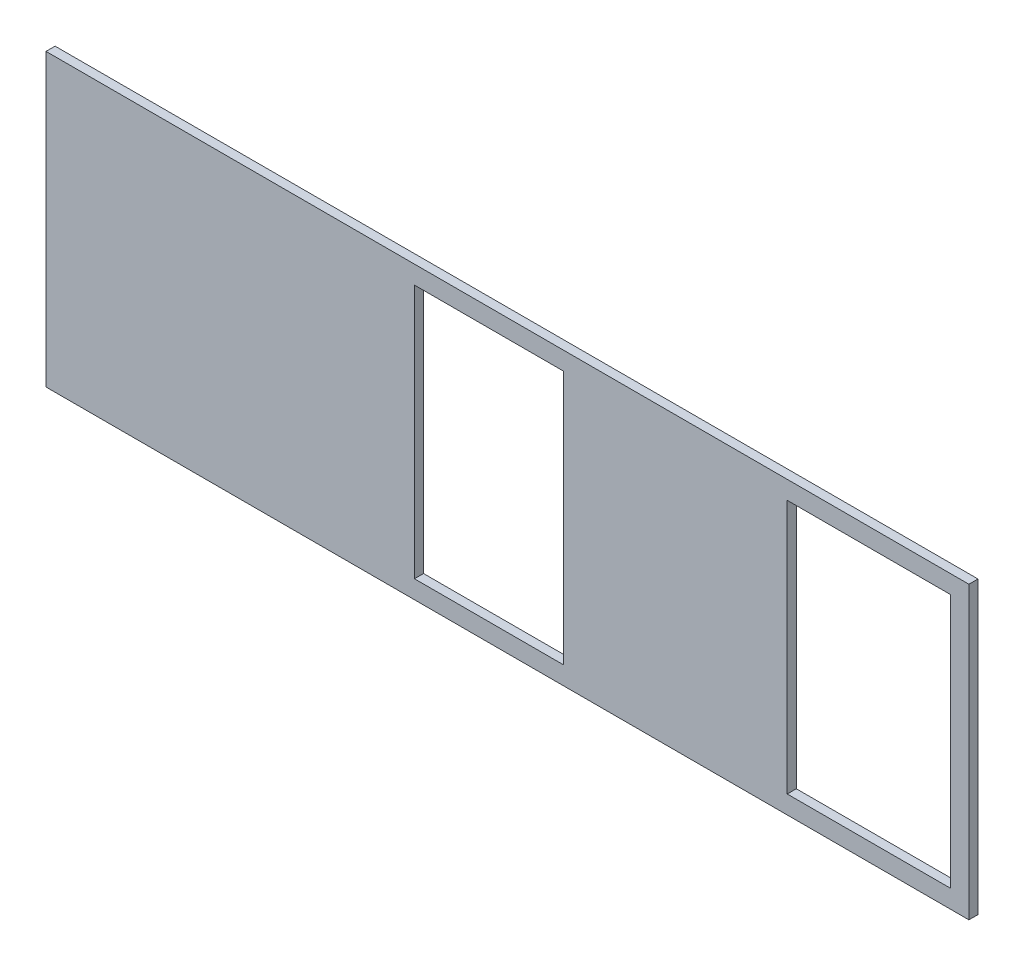
ISO-10303-21;
HEADER;
FILE_DESCRIPTION(('STEP AP214'),'2;1');
FILE_NAME('part.step','',(''),(''),'','','');
FILE_SCHEMA(('AUTOMOTIVE_DESIGN { 1 0 10303 214 1 1 1 1 }'));
ENDSEC;
DATA;
#1=APPLICATION_CONTEXT('core data for automotive mechanical design processes');
#2=APPLICATION_PROTOCOL_DEFINITION('international standard','automotive_design',2000,#1);
#3=PRODUCT_CONTEXT('',#1,'mechanical');
#4=PRODUCT('Part','Part','',(#3));
#5=PRODUCT_RELATED_PRODUCT_CATEGORY('part','',(#4));
#6=PRODUCT_DEFINITION_FORMATION('','',#4);
#7=PRODUCT_DEFINITION_CONTEXT('part definition',#1,'design');
#8=PRODUCT_DEFINITION('design','',#6,#7);
#9=PRODUCT_DEFINITION_SHAPE('','',#8);
#10=(LENGTH_UNIT() NAMED_UNIT(*) SI_UNIT(.MILLI.,.METRE.));
#11=(NAMED_UNIT(*) PLANE_ANGLE_UNIT() SI_UNIT($,.RADIAN.));
#12=(NAMED_UNIT(*) SI_UNIT($,.STERADIAN.) SOLID_ANGLE_UNIT());
#13=UNCERTAINTY_MEASURE_WITH_UNIT(LENGTH_MEASURE(1.E-05),#10,'distance_accuracy_value','');
#14=(GEOMETRIC_REPRESENTATION_CONTEXT(3) GLOBAL_UNCERTAINTY_ASSIGNED_CONTEXT((#13)) GLOBAL_UNIT_ASSIGNED_CONTEXT((#10,
#11,#12)) REPRESENTATION_CONTEXT('',''));
#15=CARTESIAN_POINT('',(0.,0.,0.));
#16=DIRECTION('',(0.,0.,1.));
#17=DIRECTION('',(1.,0.,0.));
#18=AXIS2_PLACEMENT_3D('',#15,#16,#17);
#19=CARTESIAN_POINT('',(0.,0.,3.175));
#20=DIRECTION('',(1.,0.,0.));
#21=DIRECTION('',(0.,0.,-1.));
#22=AXIS2_PLACEMENT_3D('',#19,#20,#21);
#23=PLANE('',#22);
#24=DIRECTION('',(0.,-1.,0.));
#25=VECTOR('',#24,1.);
#26=CARTESIAN_POINT('',(0.,0.,0.));
#27=LINE('',#26,#25);
#28=CARTESIAN_POINT('',(0.,101.6,0.));
#29=VERTEX_POINT('',#28);
#30=CARTESIAN_POINT('',(0.,0.,0.));
#31=VERTEX_POINT('',#30);
#32=EDGE_CURVE('E162',#29,#31,#27,.T.);
#33=ORIENTED_EDGE('',*,*,#32,.T.);
#34=DIRECTION('',(0.,0.,-1.));
#35=VECTOR('',#34,1.);
#36=CARTESIAN_POINT('',(0.,0.,3.175));
#37=LINE('',#36,#35);
#38=CARTESIAN_POINT('',(0.,0.,3.175));
#39=VERTEX_POINT('',#38);
#40=EDGE_CURVE('E11',#39,#31,#37,.T.);
#41=ORIENTED_EDGE('',*,*,#40,.F.);
#42=DIRECTION('',(0.,-1.,0.));
#43=VECTOR('',#42,1.);
#44=CARTESIAN_POINT('',(0.,0.,3.175));
#45=LINE('',#44,#43);
#46=CARTESIAN_POINT('',(0.,101.6,3.175));
#47=VERTEX_POINT('',#46);
#48=EDGE_CURVE('E195',#47,#39,#45,.T.);
#49=ORIENTED_EDGE('',*,*,#48,.F.);
#50=DIRECTION('',(0.,0.,-1.));
#51=VECTOR('',#50,1.);
#52=CARTESIAN_POINT('',(0.,101.6,3.175));
#53=LINE('',#52,#51);
#54=EDGE_CURVE('E205',#47,#29,#53,.T.);
#55=ORIENTED_EDGE('',*,*,#54,.T.);
#56=EDGE_LOOP('',(#33,#41,#49,#55));
#57=FACE_BOUND('',#56,.T.);
#58=ADVANCED_FACE('F37',(#57),#23,.F.);
#59=CARTESIAN_POINT('',(0.,0.,3.175));
#60=DIRECTION('',(0.,1.,0.));
#61=DIRECTION('',(0.,0.,1.));
#62=AXIS2_PLACEMENT_3D('',#59,#60,#61);
#63=PLANE('',#62);
#64=DIRECTION('',(1.,0.,0.));
#65=VECTOR('',#64,1.);
#66=CARTESIAN_POINT('',(0.,0.,0.));
#67=LINE('',#66,#65);
#68=CARTESIAN_POINT('',(322.58,0.,0.));
#69=VERTEX_POINT('',#68);
#70=EDGE_CURVE('E208',#31,#69,#67,.T.);
#71=ORIENTED_EDGE('',*,*,#70,.T.);
#72=DIRECTION('',(0.,0.,-1.));
#73=VECTOR('',#72,1.);
#74=CARTESIAN_POINT('',(322.58,0.,3.175));
#75=LINE('',#74,#73);
#76=CARTESIAN_POINT('',(322.58,0.,3.175));
#77=VERTEX_POINT('',#76);
#78=EDGE_CURVE('E44',#77,#69,#75,.T.);
#79=ORIENTED_EDGE('',*,*,#78,.F.);
#80=DIRECTION('',(1.,0.,0.));
#81=VECTOR('',#80,1.);
#82=CARTESIAN_POINT('',(0.,0.,3.175));
#83=LINE('',#82,#81);
#84=EDGE_CURVE('E198',#39,#77,#83,.T.);
#85=ORIENTED_EDGE('',*,*,#84,.F.);
#86=ORIENTED_EDGE('',*,*,#40,.T.);
#87=EDGE_LOOP('',(#71,#79,#85,#86));
#88=FACE_BOUND('',#87,.T.);
#89=ADVANCED_FACE('F237',(#88),#63,.F.);
#90=CARTESIAN_POINT('',(322.58,0.,3.175));
#91=DIRECTION('',(-1.,0.,0.));
#92=DIRECTION('',(0.,0.,1.));
#93=AXIS2_PLACEMENT_3D('',#90,#91,#92);
#94=PLANE('',#93);
#95=DIRECTION('',(0.,1.,0.));
#96=VECTOR('',#95,1.);
#97=CARTESIAN_POINT('',(322.58,0.,0.));
#98=LINE('',#97,#96);
#99=CARTESIAN_POINT('',(322.58,101.6,0.));
#100=VERTEX_POINT('',#99);
#101=EDGE_CURVE('E210',#69,#100,#98,.T.);
#102=ORIENTED_EDGE('',*,*,#101,.T.);
#103=DIRECTION('',(0.,0.,-1.));
#104=VECTOR('',#103,1.);
#105=CARTESIAN_POINT('',(322.58,101.6,3.175));
#106=LINE('',#105,#104);
#107=CARTESIAN_POINT('',(322.58,101.6,3.175));
#108=VERTEX_POINT('',#107);
#109=EDGE_CURVE('E215',#108,#100,#106,.T.);
#110=ORIENTED_EDGE('',*,*,#109,.F.);
#111=DIRECTION('',(0.,1.,0.));
#112=VECTOR('',#111,1.);
#113=CARTESIAN_POINT('',(322.58,0.,3.175));
#114=LINE('',#113,#112);
#115=EDGE_CURVE('E201',#77,#108,#114,.T.);
#116=ORIENTED_EDGE('',*,*,#115,.F.);
#117=ORIENTED_EDGE('',*,*,#78,.T.);
#118=EDGE_LOOP('',(#102,#110,#116,#117));
#119=FACE_BOUND('',#118,.T.);
#120=ADVANCED_FACE('F222',(#119),#94,.F.);
#121=CARTESIAN_POINT('',(0.,101.6,3.175));
#122=DIRECTION('',(0.,-1.,0.));
#123=DIRECTION('',(0.,0.,-1.));
#124=AXIS2_PLACEMENT_3D('',#121,#122,#123);
#125=PLANE('',#124);
#126=DIRECTION('',(-1.,0.,0.));
#127=VECTOR('',#126,1.);
#128=CARTESIAN_POINT('',(0.,101.6,0.));
#129=LINE('',#128,#127);
#130=EDGE_CURVE('E199',#100,#29,#129,.T.);
#131=ORIENTED_EDGE('',*,*,#130,.T.);
#132=ORIENTED_EDGE('',*,*,#54,.F.);
#133=DIRECTION('',(-1.,0.,0.));
#134=VECTOR('',#133,1.);
#135=CARTESIAN_POINT('',(0.,101.6,3.175));
#136=LINE('',#135,#134);
#137=EDGE_CURVE('E203',#108,#47,#136,.T.);
#138=ORIENTED_EDGE('',*,*,#137,.F.);
#139=ORIENTED_EDGE('',*,*,#109,.T.);
#140=EDGE_LOOP('',(#131,#132,#138,#139));
#141=FACE_BOUND('',#140,.T.);
#142=ADVANCED_FACE('F230',(#141),#125,.F.);
#143=CARTESIAN_POINT('',(0.,0.,3.175));
#144=DIRECTION('',(0.,0.,-1.));
#145=DIRECTION('',(-1.,0.,0.));
#146=AXIS2_PLACEMENT_3D('',#143,#144,#145);
#147=PLANE('',#146);
#148=DIRECTION('',(0.,-1.,0.));
#149=VECTOR('',#148,1.);
#150=CARTESIAN_POINT('',(128.778,95.25,3.175));
#151=LINE('',#150,#149);
#152=CARTESIAN_POINT('',(128.778,95.25,3.175));
#153=VERTEX_POINT('',#152);
#154=CARTESIAN_POINT('',(128.778,6.35,3.175));
#155=VERTEX_POINT('',#154);
#156=EDGE_CURVE('E155',#153,#155,#151,.T.);
#157=ORIENTED_EDGE('',*,*,#156,.F.);
#158=DIRECTION('',(-1.,0.,0.));
#159=VECTOR('',#158,1.);
#160=CARTESIAN_POINT('',(180.848,95.25,3.175));
#161=LINE('',#160,#159);
#162=CARTESIAN_POINT('',(180.848,95.25,3.175));
#163=VERTEX_POINT('',#162);
#164=EDGE_CURVE('E51',#163,#153,#161,.T.);
#165=ORIENTED_EDGE('',*,*,#164,.F.);
#166=DIRECTION('',(0.,1.,0.));
#167=VECTOR('',#166,1.);
#168=CARTESIAN_POINT('',(180.848,6.35,3.175));
#169=LINE('',#168,#167);
#170=CARTESIAN_POINT('',(180.848,6.35,3.175));
#171=VERTEX_POINT('',#170);
#172=EDGE_CURVE('E146',#171,#163,#169,.T.);
#173=ORIENTED_EDGE('',*,*,#172,.F.);
#174=DIRECTION('',(1.,0.,0.));
#175=VECTOR('',#174,1.);
#176=CARTESIAN_POINT('',(128.778,6.35,3.175));
#177=LINE('',#176,#175);
#178=EDGE_CURVE('E149',#155,#171,#177,.T.);
#179=ORIENTED_EDGE('',*,*,#178,.F.);
#180=EDGE_LOOP('',(#157,#165,#173,#179));
#181=FACE_BOUND('',#180,.T.);
#182=DIRECTION('',(1.,0.,0.));
#183=VECTOR('',#182,1.);
#184=CARTESIAN_POINT('',(259.08,6.35,3.175));
#185=LINE('',#184,#183);
#186=CARTESIAN_POINT('',(259.08,6.35,3.175));
#187=VERTEX_POINT('',#186);
#188=CARTESIAN_POINT('',(316.23,6.35,3.175));
#189=VERTEX_POINT('',#188);
#190=EDGE_CURVE('E181',#187,#189,#185,.T.);
#191=ORIENTED_EDGE('',*,*,#190,.F.);
#192=DIRECTION('',(0.,-1.,0.));
#193=VECTOR('',#192,1.);
#194=CARTESIAN_POINT('',(259.08,95.25,3.175));
#195=LINE('',#194,#193);
#196=CARTESIAN_POINT('',(259.08,95.25,3.175));
#197=VERTEX_POINT('',#196);
#198=EDGE_CURVE('E59',#197,#187,#195,.T.);
#199=ORIENTED_EDGE('',*,*,#198,.F.);
#200=DIRECTION('',(-1.,0.,0.));
#201=VECTOR('',#200,1.);
#202=CARTESIAN_POINT('',(259.08,95.25,3.175));
#203=LINE('',#202,#201);
#204=CARTESIAN_POINT('',(316.23,95.25,3.175));
#205=VERTEX_POINT('',#204);
#206=EDGE_CURVE('E170',#205,#197,#203,.T.);
#207=ORIENTED_EDGE('',*,*,#206,.F.);
#208=DIRECTION('',(0.,1.,0.));
#209=VECTOR('',#208,1.);
#210=CARTESIAN_POINT('',(316.23,95.25,3.175));
#211=LINE('',#210,#209);
#212=EDGE_CURVE('E184',#189,#205,#211,.T.);
#213=ORIENTED_EDGE('',*,*,#212,.F.);
#214=EDGE_LOOP('',(#191,#199,#207,#213));
#215=FACE_BOUND('',#214,.T.);
#216=ORIENTED_EDGE('',*,*,#48,.T.);
#217=ORIENTED_EDGE('',*,*,#84,.T.);
#218=ORIENTED_EDGE('',*,*,#115,.T.);
#219=ORIENTED_EDGE('',*,*,#137,.T.);
#220=EDGE_LOOP('',(#216,#217,#218,#219));
#221=FACE_BOUND('',#220,.T.);
#222=ADVANCED_FACE('F236',(#181,#215,#221),#147,.F.);
#223=CARTESIAN_POINT('',(0.,0.,0.));
#224=DIRECTION('',(0.,0.,-1.));
#225=DIRECTION('',(-1.,0.,0.));
#226=AXIS2_PLACEMENT_3D('',#223,#224,#225);
#227=PLANE('',#226);
#228=DIRECTION('',(-1.,0.,0.));
#229=VECTOR('',#228,1.);
#230=CARTESIAN_POINT('',(180.848,95.25,0.));
#231=LINE('',#230,#229);
#232=CARTESIAN_POINT('',(180.848,95.25,0.));
#233=VERTEX_POINT('',#232);
#234=CARTESIAN_POINT('',(128.778,95.25,0.));
#235=VERTEX_POINT('',#234);
#236=EDGE_CURVE('E127',#233,#235,#231,.T.);
#237=ORIENTED_EDGE('',*,*,#236,.T.);
#238=DIRECTION('',(0.,-1.,0.));
#239=VECTOR('',#238,1.);
#240=CARTESIAN_POINT('',(128.778,95.25,0.));
#241=LINE('',#240,#239);
#242=CARTESIAN_POINT('',(128.778,6.35,0.));
#243=VERTEX_POINT('',#242);
#244=EDGE_CURVE('E137',#235,#243,#241,.T.);
#245=ORIENTED_EDGE('',*,*,#244,.T.);
#246=DIRECTION('',(1.,0.,0.));
#247=VECTOR('',#246,1.);
#248=CARTESIAN_POINT('',(128.778,6.35,0.));
#249=LINE('',#248,#247);
#250=CARTESIAN_POINT('',(180.848,6.35,0.));
#251=VERTEX_POINT('',#250);
#252=EDGE_CURVE('E141',#243,#251,#249,.T.);
#253=ORIENTED_EDGE('',*,*,#252,.T.);
#254=DIRECTION('',(0.,1.,0.));
#255=VECTOR('',#254,1.);
#256=CARTESIAN_POINT('',(180.848,6.35,0.));
#257=LINE('',#256,#255);
#258=EDGE_CURVE('E133',#251,#233,#257,.T.);
#259=ORIENTED_EDGE('',*,*,#258,.T.);
#260=EDGE_LOOP('',(#237,#245,#253,#259));
#261=FACE_BOUND('',#260,.T.);
#262=DIRECTION('',(0.,-1.,0.));
#263=VECTOR('',#262,1.);
#264=CARTESIAN_POINT('',(259.08,95.25,0.));
#265=LINE('',#264,#263);
#266=CARTESIAN_POINT('',(259.08,95.25,0.));
#267=VERTEX_POINT('',#266);
#268=CARTESIAN_POINT('',(259.08,6.35,0.));
#269=VERTEX_POINT('',#268);
#270=EDGE_CURVE('E166',#267,#269,#265,.T.);
#271=ORIENTED_EDGE('',*,*,#270,.T.);
#272=DIRECTION('',(1.,0.,0.));
#273=VECTOR('',#272,1.);
#274=CARTESIAN_POINT('',(259.08,6.35,0.));
#275=LINE('',#274,#273);
#276=CARTESIAN_POINT('',(316.23,6.35,0.));
#277=VERTEX_POINT('',#276);
#278=EDGE_CURVE('E169',#269,#277,#275,.T.);
#279=ORIENTED_EDGE('',*,*,#278,.T.);
#280=DIRECTION('',(0.,1.,0.));
#281=VECTOR('',#280,1.);
#282=CARTESIAN_POINT('',(316.23,95.25,0.));
#283=LINE('',#282,#281);
#284=CARTESIAN_POINT('',(316.23,95.25,0.));
#285=VERTEX_POINT('',#284);
#286=EDGE_CURVE('E173',#277,#285,#283,.T.);
#287=ORIENTED_EDGE('',*,*,#286,.T.);
#288=DIRECTION('',(-1.,0.,0.));
#289=VECTOR('',#288,1.);
#290=CARTESIAN_POINT('',(259.08,95.25,0.));
#291=LINE('',#290,#289);
#292=EDGE_CURVE('E176',#285,#267,#291,.T.);
#293=ORIENTED_EDGE('',*,*,#292,.T.);
#294=EDGE_LOOP('',(#271,#279,#287,#293));
#295=FACE_BOUND('',#294,.T.);
#296=ORIENTED_EDGE('',*,*,#32,.F.);
#297=ORIENTED_EDGE('',*,*,#130,.F.);
#298=ORIENTED_EDGE('',*,*,#101,.F.);
#299=ORIENTED_EDGE('',*,*,#70,.F.);
#300=EDGE_LOOP('',(#296,#297,#298,#299));
#301=FACE_BOUND('',#300,.T.);
#302=ADVANCED_FACE('F143',(#261,#295,#301),#227,.T.);
#303=CARTESIAN_POINT('',(259.08,95.25,0.));
#304=DIRECTION('',(-1.,0.,0.));
#305=DIRECTION('',(0.,0.,1.));
#306=AXIS2_PLACEMENT_3D('',#303,#304,#305);
#307=PLANE('',#306);
#308=ORIENTED_EDGE('',*,*,#198,.T.);
#309=DIRECTION('',(0.,0.,1.));
#310=VECTOR('',#309,1.);
#311=CARTESIAN_POINT('',(259.08,6.35,0.));
#312=LINE('',#311,#310);
#313=EDGE_CURVE('E179',#269,#187,#312,.T.);
#314=ORIENTED_EDGE('',*,*,#313,.F.);
#315=ORIENTED_EDGE('',*,*,#270,.F.);
#316=DIRECTION('',(0.,0.,1.));
#317=VECTOR('',#316,1.);
#318=CARTESIAN_POINT('',(259.08,95.25,0.));
#319=LINE('',#318,#317);
#320=EDGE_CURVE('E156',#267,#197,#319,.T.);
#321=ORIENTED_EDGE('',*,*,#320,.T.);
#322=EDGE_LOOP('',(#308,#314,#315,#321));
#323=FACE_BOUND('',#322,.T.);
#324=ADVANCED_FACE('F249',(#323),#307,.F.);
#325=CARTESIAN_POINT('',(259.08,95.25,0.));
#326=DIRECTION('',(0.,1.,0.));
#327=DIRECTION('',(-1.,0.,0.));
#328=AXIS2_PLACEMENT_3D('',#325,#326,#327);
#329=PLANE('',#328);
#330=ORIENTED_EDGE('',*,*,#206,.T.);
#331=ORIENTED_EDGE('',*,*,#320,.F.);
#332=ORIENTED_EDGE('',*,*,#292,.F.);
#333=DIRECTION('',(0.,0.,1.));
#334=VECTOR('',#333,1.);
#335=CARTESIAN_POINT('',(316.23,95.25,0.));
#336=LINE('',#335,#334);
#337=EDGE_CURVE('E190',#285,#205,#336,.T.);
#338=ORIENTED_EDGE('',*,*,#337,.T.);
#339=EDGE_LOOP('',(#330,#331,#332,#338));
#340=FACE_BOUND('',#339,.T.);
#341=ADVANCED_FACE('F255',(#340),#329,.F.);
#342=CARTESIAN_POINT('',(316.23,95.25,0.));
#343=DIRECTION('',(1.,0.,0.));
#344=DIRECTION('',(0.,0.,-1.));
#345=AXIS2_PLACEMENT_3D('',#342,#343,#344);
#346=PLANE('',#345);
#347=ORIENTED_EDGE('',*,*,#212,.T.);
#348=ORIENTED_EDGE('',*,*,#337,.F.);
#349=ORIENTED_EDGE('',*,*,#286,.F.);
#350=DIRECTION('',(0.,0.,1.));
#351=VECTOR('',#350,1.);
#352=CARTESIAN_POINT('',(316.23,6.35,0.));
#353=LINE('',#352,#351);
#354=EDGE_CURVE('E192',#277,#189,#353,.T.);
#355=ORIENTED_EDGE('',*,*,#354,.T.);
#356=EDGE_LOOP('',(#347,#348,#349,#355));
#357=FACE_BOUND('',#356,.T.);
#358=ADVANCED_FACE('F259',(#357),#346,.F.);
#359=CARTESIAN_POINT('',(259.08,6.35,0.));
#360=DIRECTION('',(0.,-1.,0.));
#361=DIRECTION('',(0.,0.,-1.));
#362=AXIS2_PLACEMENT_3D('',#359,#360,#361);
#363=PLANE('',#362);
#364=ORIENTED_EDGE('',*,*,#190,.T.);
#365=ORIENTED_EDGE('',*,*,#354,.F.);
#366=ORIENTED_EDGE('',*,*,#278,.F.);
#367=ORIENTED_EDGE('',*,*,#313,.T.);
#368=EDGE_LOOP('',(#364,#365,#366,#367));
#369=FACE_BOUND('',#368,.T.);
#370=ADVANCED_FACE('F256',(#369),#363,.F.);
#371=CARTESIAN_POINT('',(180.848,95.25,0.));
#372=DIRECTION('',(0.,1.,0.));
#373=DIRECTION('',(0.,0.,1.));
#374=AXIS2_PLACEMENT_3D('',#371,#372,#373);
#375=PLANE('',#374);
#376=ORIENTED_EDGE('',*,*,#164,.T.);
#377=DIRECTION('',(0.,0.,1.));
#378=VECTOR('',#377,1.);
#379=CARTESIAN_POINT('',(128.778,95.25,0.));
#380=LINE('',#379,#378);
#381=EDGE_CURVE('E123',#235,#153,#380,.T.);
#382=ORIENTED_EDGE('',*,*,#381,.F.);
#383=ORIENTED_EDGE('',*,*,#236,.F.);
#384=DIRECTION('',(0.,0.,1.));
#385=VECTOR('',#384,1.);
#386=CARTESIAN_POINT('',(180.848,95.25,0.));
#387=LINE('',#386,#385);
#388=EDGE_CURVE('E160',#233,#163,#387,.T.);
#389=ORIENTED_EDGE('',*,*,#388,.T.);
#390=EDGE_LOOP('',(#376,#382,#383,#389));
#391=FACE_BOUND('',#390,.T.);
#392=ADVANCED_FACE('F125',(#391),#375,.F.);
#393=CARTESIAN_POINT('',(180.848,6.35,0.));
#394=DIRECTION('',(1.,0.,0.));
#395=DIRECTION('',(0.,0.,-1.));
#396=AXIS2_PLACEMENT_3D('',#393,#394,#395);
#397=PLANE('',#396);
#398=ORIENTED_EDGE('',*,*,#172,.T.);
#399=ORIENTED_EDGE('',*,*,#388,.F.);
#400=ORIENTED_EDGE('',*,*,#258,.F.);
#401=DIRECTION('',(0.,0.,1.));
#402=VECTOR('',#401,1.);
#403=CARTESIAN_POINT('',(180.848,6.35,0.));
#404=LINE('',#403,#402);
#405=EDGE_CURVE('E163',#251,#171,#404,.T.);
#406=ORIENTED_EDGE('',*,*,#405,.T.);
#407=EDGE_LOOP('',(#398,#399,#400,#406));
#408=FACE_BOUND('',#407,.T.);
#409=ADVANCED_FACE('F269',(#408),#397,.F.);
#410=CARTESIAN_POINT('',(128.778,6.35,0.));
#411=DIRECTION('',(0.,-1.,0.));
#412=DIRECTION('',(0.,0.,-1.));
#413=AXIS2_PLACEMENT_3D('',#410,#411,#412);
#414=PLANE('',#413);
#415=ORIENTED_EDGE('',*,*,#178,.T.);
#416=ORIENTED_EDGE('',*,*,#405,.F.);
#417=ORIENTED_EDGE('',*,*,#252,.F.);
#418=DIRECTION('',(0.,0.,1.));
#419=VECTOR('',#418,1.);
#420=CARTESIAN_POINT('',(128.778,6.35,0.));
#421=LINE('',#420,#419);
#422=EDGE_CURVE('E132',#243,#155,#421,.T.);
#423=ORIENTED_EDGE('',*,*,#422,.T.);
#424=EDGE_LOOP('',(#415,#416,#417,#423));
#425=FACE_BOUND('',#424,.T.);
#426=ADVANCED_FACE('F272',(#425),#414,.F.);
#427=CARTESIAN_POINT('',(128.778,95.25,0.));
#428=DIRECTION('',(-1.,0.,0.));
#429=DIRECTION('',(0.,0.,1.));
#430=AXIS2_PLACEMENT_3D('',#427,#428,#429);
#431=PLANE('',#430);
#432=ORIENTED_EDGE('',*,*,#156,.T.);
#433=ORIENTED_EDGE('',*,*,#422,.F.);
#434=ORIENTED_EDGE('',*,*,#244,.F.);
#435=ORIENTED_EDGE('',*,*,#381,.T.);
#436=EDGE_LOOP('',(#432,#433,#434,#435));
#437=FACE_BOUND('',#436,.T.);
#438=ADVANCED_FACE('F138',(#437),#431,.F.);
#439=CLOSED_SHELL('',(#58,#89,#120,#142,#222,#302,#324,#341,#358,#370,#392,#409,#426,#438));
#440=MANIFOLD_SOLID_BREP('B2',#439);
#441=ADVANCED_BREP_SHAPE_REPRESENTATION('',(#18,#440),#14);
#442=SHAPE_DEFINITION_REPRESENTATION(#9,#441);
ENDSEC;
END-ISO-10303-21;
